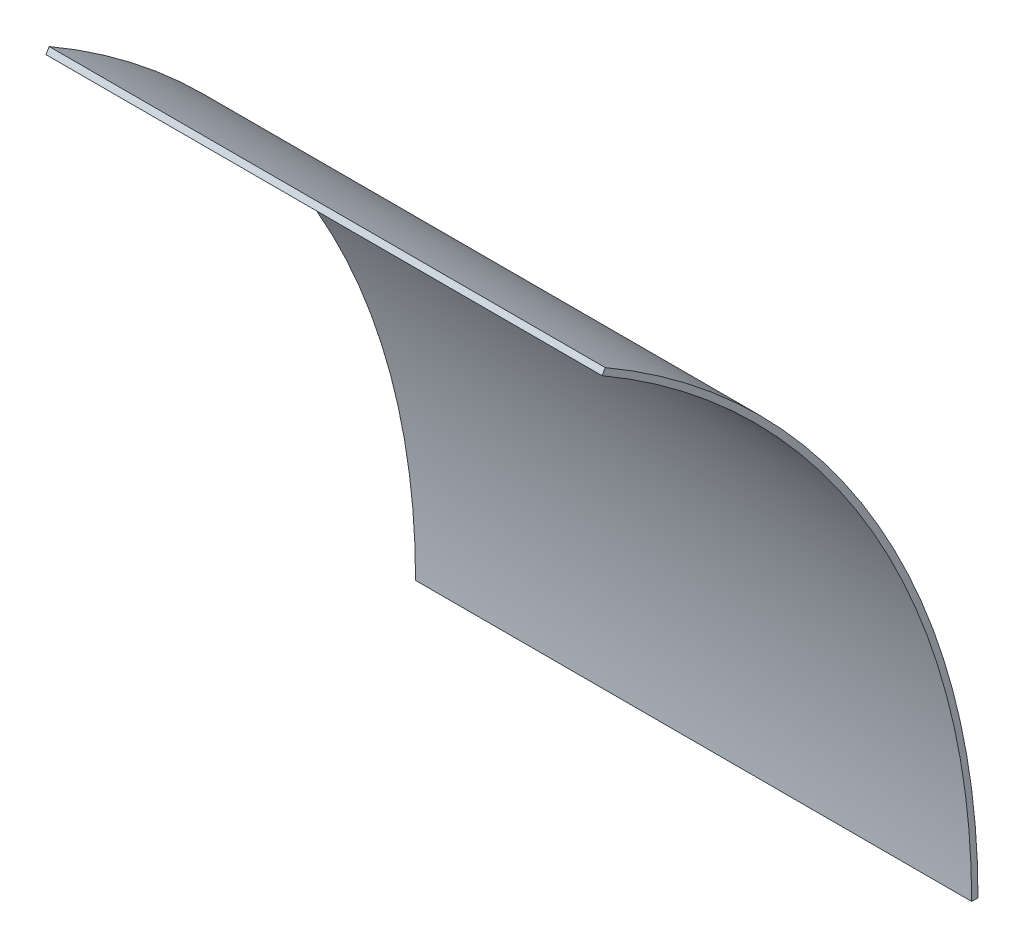
ISO-10303-21;
HEADER;
FILE_DESCRIPTION(('STEP AP214'),'2;1');
FILE_NAME('part.step','',(''),(''),'','','');
FILE_SCHEMA(('AUTOMOTIVE_DESIGN { 1 0 10303 214 1 1 1 1 }'));
ENDSEC;
DATA;
#1=APPLICATION_CONTEXT('core data for automotive mechanical design processes');
#2=APPLICATION_PROTOCOL_DEFINITION('international standard','automotive_design',2000,#1);
#3=PRODUCT_CONTEXT('',#1,'mechanical');
#4=PRODUCT('Part','Part','',(#3));
#5=PRODUCT_RELATED_PRODUCT_CATEGORY('part','',(#4));
#6=PRODUCT_DEFINITION_FORMATION('','',#4);
#7=PRODUCT_DEFINITION_CONTEXT('part definition',#1,'design');
#8=PRODUCT_DEFINITION('design','',#6,#7);
#9=PRODUCT_DEFINITION_SHAPE('','',#8);
#10=(LENGTH_UNIT() NAMED_UNIT(*) SI_UNIT(.MILLI.,.METRE.));
#11=(NAMED_UNIT(*) PLANE_ANGLE_UNIT() SI_UNIT($,.RADIAN.));
#12=(NAMED_UNIT(*) SI_UNIT($,.STERADIAN.) SOLID_ANGLE_UNIT());
#13=UNCERTAINTY_MEASURE_WITH_UNIT(LENGTH_MEASURE(1.E-05),#10,'distance_accuracy_value','');
#14=(GEOMETRIC_REPRESENTATION_CONTEXT(3) GLOBAL_UNCERTAINTY_ASSIGNED_CONTEXT((#13)) GLOBAL_UNIT_ASSIGNED_CONTEXT((#10,
#11,#12)) REPRESENTATION_CONTEXT('',''));
#15=CARTESIAN_POINT('',(0.,0.,0.));
#16=DIRECTION('',(0.,0.,1.));
#17=DIRECTION('',(1.,0.,0.));
#18=AXIS2_PLACEMENT_3D('',#15,#16,#17);
#19=CARTESIAN_POINT('',(139.7,0.,0.));
#20=DIRECTION('',(-1.,0.,0.));
#21=DIRECTION('',(0.,0.,1.));
#22=AXIS2_PLACEMENT_3D('',#19,#20,#21);
#23=CYLINDRICAL_SURFACE('',#22,185.674);
#24=CARTESIAN_POINT('',(0.,0.,0.));
#25=DIRECTION('',(-1.,0.,0.));
#26=DIRECTION('',(0.,0.,-1.));
#27=AXIS2_PLACEMENT_3D('',#24,#25,#26);
#28=CIRCLE('',#27,185.674);
#29=CARTESIAN_POINT('',(0.,160.798400822272,-92.8369999999996));
#30=VERTEX_POINT('',#29);
#31=CARTESIAN_POINT('',(0.,0.,-185.674));
#32=VERTEX_POINT('',#31);
#33=EDGE_CURVE('E99',#30,#32,#28,.T.);
#34=ORIENTED_EDGE('',*,*,#33,.T.);
#35=DIRECTION('',(-1.,0.,0.));
#36=VECTOR('',#35,1.);
#37=CARTESIAN_POINT('',(139.7,0.,-185.674));
#38=LINE('',#37,#36);
#39=CARTESIAN_POINT('',(139.7,0.,-185.674));
#40=VERTEX_POINT('',#39);
#41=EDGE_CURVE('E11',#40,#32,#38,.T.);
#42=ORIENTED_EDGE('',*,*,#41,.F.);
#43=CARTESIAN_POINT('',(139.7,0.,0.));
#44=DIRECTION('',(-1.,0.,0.));
#45=DIRECTION('',(0.,0.,-1.));
#46=AXIS2_PLACEMENT_3D('',#43,#44,#45);
#47=CIRCLE('',#46,185.674);
#48=CARTESIAN_POINT('',(139.7,160.798400822272,-92.8369999999996));
#49=VERTEX_POINT('',#48);
#50=EDGE_CURVE('E87',#49,#40,#47,.T.);
#51=ORIENTED_EDGE('',*,*,#50,.F.);
#52=DIRECTION('',(-1.,0.,0.));
#53=VECTOR('',#52,1.);
#54=CARTESIAN_POINT('',(139.7,160.798400822272,-92.8369999999996));
#55=LINE('',#54,#53);
#56=EDGE_CURVE('E95',#49,#30,#55,.T.);
#57=ORIENTED_EDGE('',*,*,#56,.T.);
#58=EDGE_LOOP('',(#34,#42,#51,#57));
#59=FACE_BOUND('',#58,.T.);
#60=ADVANCED_FACE('F36',(#59),#23,.F.);
#61=CARTESIAN_POINT('',(139.7,0.,-187.2615));
#62=DIRECTION('',(0.,1.,0.));
#63=DIRECTION('',(0.,0.,1.));
#64=AXIS2_PLACEMENT_3D('',#61,#62,#63);
#65=PLANE('',#64);
#66=DIRECTION('',(0.,0.,-1.));
#67=VECTOR('',#66,1.);
#68=CARTESIAN_POINT('',(0.,0.,-187.2615));
#69=LINE('',#68,#67);
#70=CARTESIAN_POINT('',(0.,0.,-187.2615));
#71=VERTEX_POINT('',#70);
#72=EDGE_CURVE('E91',#32,#71,#69,.T.);
#73=ORIENTED_EDGE('',*,*,#72,.T.);
#74=DIRECTION('',(-1.,0.,0.));
#75=VECTOR('',#74,1.);
#76=CARTESIAN_POINT('',(139.7,0.,-187.2615));
#77=LINE('',#76,#75);
#78=CARTESIAN_POINT('',(139.7,0.,-187.2615));
#79=VERTEX_POINT('',#78);
#80=EDGE_CURVE('E44',#79,#71,#77,.T.);
#81=ORIENTED_EDGE('',*,*,#80,.F.);
#82=DIRECTION('',(0.,0.,-1.));
#83=VECTOR('',#82,1.);
#84=CARTESIAN_POINT('',(139.7,0.,-187.2615));
#85=LINE('',#84,#83);
#86=EDGE_CURVE('E82',#40,#79,#85,.T.);
#87=ORIENTED_EDGE('',*,*,#86,.F.);
#88=ORIENTED_EDGE('',*,*,#41,.T.);
#89=EDGE_LOOP('',(#73,#81,#87,#88));
#90=FACE_BOUND('',#89,.T.);
#91=ADVANCED_FACE('F90',(#90),#65,.F.);
#92=CARTESIAN_POINT('',(139.7,0.,0.));
#93=DIRECTION('',(-1.,0.,0.));
#94=DIRECTION('',(0.,0.,1.));
#95=AXIS2_PLACEMENT_3D('',#92,#93,#94);
#96=CYLINDRICAL_SURFACE('',#95,187.2615);
#97=CARTESIAN_POINT('',(0.,0.,0.));
#98=DIRECTION('',(1.,0.,0.));
#99=DIRECTION('',(0.,0.,-1.));
#100=AXIS2_PLACEMENT_3D('',#97,#98,#99);
#101=CIRCLE('',#100,187.2615);
#102=CARTESIAN_POINT('',(0.,162.17321615078,-93.6307499999996));
#103=VERTEX_POINT('',#102);
#104=EDGE_CURVE('E69',#71,#103,#101,.T.);
#105=ORIENTED_EDGE('',*,*,#104,.T.);
#106=DIRECTION('',(-1.,0.,0.));
#107=VECTOR('',#106,1.);
#108=CARTESIAN_POINT('',(139.7,162.17321615078,-93.6307499999996));
#109=LINE('',#108,#107);
#110=CARTESIAN_POINT('',(139.7,162.17321615078,-93.6307499999996));
#111=VERTEX_POINT('',#110);
#112=EDGE_CURVE('E92',#111,#103,#109,.T.);
#113=ORIENTED_EDGE('',*,*,#112,.F.);
#114=CARTESIAN_POINT('',(139.7,0.,0.));
#115=DIRECTION('',(1.,0.,0.));
#116=DIRECTION('',(0.,0.,-1.));
#117=AXIS2_PLACEMENT_3D('',#114,#115,#116);
#118=CIRCLE('',#117,187.2615);
#119=EDGE_CURVE('E85',#79,#111,#118,.T.);
#120=ORIENTED_EDGE('',*,*,#119,.F.);
#121=ORIENTED_EDGE('',*,*,#80,.T.);
#122=EDGE_LOOP('',(#105,#113,#120,#121));
#123=FACE_BOUND('',#122,.T.);
#124=ADVANCED_FACE('F93',(#123),#96,.T.);
#125=CARTESIAN_POINT('',(139.7,162.17321615078,-93.6307499999996));
#126=DIRECTION('',(0.,-0.499999999999996,-0.866025403784441));
#127=DIRECTION('',(0.,0.866025403784441,-0.499999999999996));
#128=AXIS2_PLACEMENT_3D('',#125,#126,#127);
#129=PLANE('',#128);
#130=DIRECTION('',(0.,-0.866025403784441,0.499999999999996));
#131=VECTOR('',#130,1.);
#132=CARTESIAN_POINT('',(0.,162.17321615078,-93.6307499999996));
#133=LINE('',#132,#131);
#134=EDGE_CURVE('E75',#103,#30,#133,.T.);
#135=ORIENTED_EDGE('',*,*,#134,.T.);
#136=ORIENTED_EDGE('',*,*,#56,.F.);
#137=DIRECTION('',(0.,-0.866025403784441,0.499999999999996));
#138=VECTOR('',#137,1.);
#139=CARTESIAN_POINT('',(139.7,162.17321615078,-93.6307499999996));
#140=LINE('',#139,#138);
#141=EDGE_CURVE('E52',#111,#49,#140,.T.);
#142=ORIENTED_EDGE('',*,*,#141,.F.);
#143=ORIENTED_EDGE('',*,*,#112,.T.);
#144=EDGE_LOOP('',(#135,#136,#142,#143));
#145=FACE_BOUND('',#144,.T.);
#146=ADVANCED_FACE('F106',(#145),#129,.F.);
#147=CARTESIAN_POINT('',(139.7,0.,0.));
#148=DIRECTION('',(1.,0.,0.));
#149=DIRECTION('',(0.,0.,-1.));
#150=AXIS2_PLACEMENT_3D('',#147,#148,#149);
#151=PLANE('',#150);
#152=ORIENTED_EDGE('',*,*,#50,.T.);
#153=ORIENTED_EDGE('',*,*,#86,.T.);
#154=ORIENTED_EDGE('',*,*,#119,.T.);
#155=ORIENTED_EDGE('',*,*,#141,.T.);
#156=EDGE_LOOP('',(#152,#153,#154,#155));
#157=FACE_BOUND('',#156,.T.);
#158=ADVANCED_FACE('F83',(#157),#151,.T.);
#159=CARTESIAN_POINT('',(0.,0.,0.));
#160=DIRECTION('',(1.,0.,0.));
#161=DIRECTION('',(0.,0.,-1.));
#162=AXIS2_PLACEMENT_3D('',#159,#160,#161);
#163=PLANE('',#162);
#164=ORIENTED_EDGE('',*,*,#33,.F.);
#165=ORIENTED_EDGE('',*,*,#134,.F.);
#166=ORIENTED_EDGE('',*,*,#104,.F.);
#167=ORIENTED_EDGE('',*,*,#72,.F.);
#168=EDGE_LOOP('',(#164,#165,#166,#167));
#169=FACE_BOUND('',#168,.T.);
#170=ADVANCED_FACE('F109',(#169),#163,.F.);
#171=CLOSED_SHELL('',(#60,#91,#124,#146,#158,#170));
#172=MANIFOLD_SOLID_BREP('B2',#171);
#173=ADVANCED_BREP_SHAPE_REPRESENTATION('',(#18,#172),#14);
#174=SHAPE_DEFINITION_REPRESENTATION(#9,#173);
ENDSEC;
END-ISO-10303-21;
